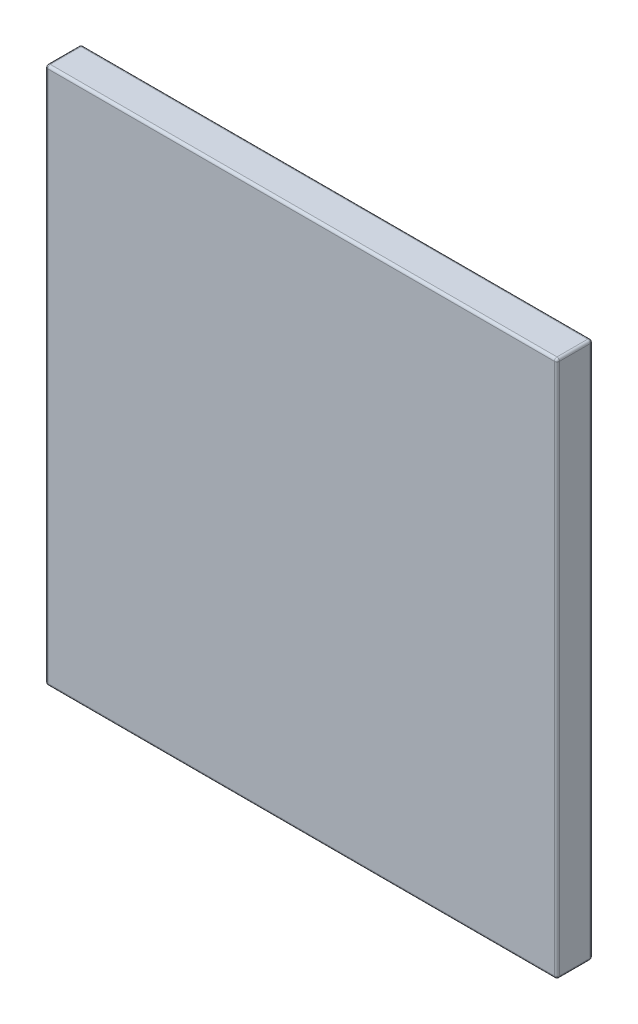
ISO-10303-21;
HEADER;
FILE_DESCRIPTION(('STEP AP214'),'2;1');
FILE_NAME('part.step','',(''),(''),'','','');
FILE_SCHEMA(('AUTOMOTIVE_DESIGN { 1 0 10303 214 1 1 1 1 }'));
ENDSEC;
DATA;
#1=APPLICATION_CONTEXT('core data for automotive mechanical design processes');
#2=APPLICATION_PROTOCOL_DEFINITION('international standard','automotive_design',2000,#1);
#3=PRODUCT_CONTEXT('',#1,'mechanical');
#4=PRODUCT('Part','Part','',(#3));
#5=PRODUCT_RELATED_PRODUCT_CATEGORY('part','',(#4));
#6=PRODUCT_DEFINITION_FORMATION('','',#4);
#7=PRODUCT_DEFINITION_CONTEXT('part definition',#1,'design');
#8=PRODUCT_DEFINITION('design','',#6,#7);
#9=PRODUCT_DEFINITION_SHAPE('','',#8);
#10=(LENGTH_UNIT() NAMED_UNIT(*) SI_UNIT(.MILLI.,.METRE.));
#11=(NAMED_UNIT(*) PLANE_ANGLE_UNIT() SI_UNIT($,.RADIAN.));
#12=(NAMED_UNIT(*) SI_UNIT($,.STERADIAN.) SOLID_ANGLE_UNIT());
#13=UNCERTAINTY_MEASURE_WITH_UNIT(LENGTH_MEASURE(1.E-05),#10,'distance_accuracy_value','');
#14=(GEOMETRIC_REPRESENTATION_CONTEXT(3) GLOBAL_UNCERTAINTY_ASSIGNED_CONTEXT((#13)) GLOBAL_UNIT_ASSIGNED_CONTEXT((#10,
#11,#12)) REPRESENTATION_CONTEXT('',''));
#15=CARTESIAN_POINT('',(0.,0.,0.));
#16=DIRECTION('',(0.,0.,1.));
#17=DIRECTION('',(1.,0.,0.));
#18=AXIS2_PLACEMENT_3D('',#15,#16,#17);
#19=CARTESIAN_POINT('',(-4.13449207157851,45.414636394646,7.));
#20=DIRECTION('',(-1.,0.,0.));
#21=DIRECTION('',(0.,-1.,0.));
#22=AXIS2_PLACEMENT_3D('',#19,#20,#21);
#23=PLANE('',#22);
#24=DIRECTION('',(0.,1.,0.));
#25=VECTOR('',#24,1.);
#26=CARTESIAN_POINT('',(-4.13449207157849,-59.585363605354,6.5));
#27=LINE('',#26,#25);
#28=CARTESIAN_POINT('',(-4.13449207157851,44.914636394646,6.5));
#29=VERTEX_POINT('',#28);
#30=CARTESIAN_POINT('',(-4.13449207157849,-59.085363605354,6.5));
#31=VERTEX_POINT('',#30);
#32=EDGE_CURVE('E174',#29,#31,#27,.F.);
#33=ORIENTED_EDGE('',*,*,#32,.T.);
#34=DIRECTION('',(0.,0.,-1.));
#35=VECTOR('',#34,1.);
#36=CARTESIAN_POINT('',(-4.13449207157849,-59.085363605354,7.));
#37=LINE('',#36,#35);
#38=CARTESIAN_POINT('',(-4.13449207157849,-59.085363605354,0.5));
#39=VERTEX_POINT('',#38);
#40=EDGE_CURVE('E141',#31,#39,#37,.T.);
#41=ORIENTED_EDGE('',*,*,#40,.T.);
#42=DIRECTION('',(0.,1.,0.));
#43=VECTOR('',#42,1.);
#44=CARTESIAN_POINT('',(-4.13449207157851,45.414636394646,0.5));
#45=LINE('',#44,#43);
#46=CARTESIAN_POINT('',(-4.13449207157851,44.914636394646,0.5));
#47=VERTEX_POINT('',#46);
#48=EDGE_CURVE('E178',#39,#47,#45,.T.);
#49=ORIENTED_EDGE('',*,*,#48,.T.);
#50=DIRECTION('',(0.,0.,-1.));
#51=VECTOR('',#50,1.);
#52=CARTESIAN_POINT('',(-4.13449207157851,44.914636394646,7.));
#53=LINE('',#52,#51);
#54=EDGE_CURVE('E176',#47,#29,#53,.F.);
#55=ORIENTED_EDGE('',*,*,#54,.T.);
#56=EDGE_LOOP('',(#33,#41,#49,#55));
#57=FACE_BOUND('',#56,.T.);
#58=ADVANCED_FACE('F34',(#57),#23,.F.);
#59=CARTESIAN_POINT('',(-104.134492071579,45.414636394646,7.));
#60=DIRECTION('',(0.,-1.,0.));
#61=DIRECTION('',(0.,0.,-1.));
#62=AXIS2_PLACEMENT_3D('',#59,#60,#61);
#63=PLANE('',#62);
#64=DIRECTION('',(-1.,0.,0.));
#65=VECTOR('',#64,1.);
#66=CARTESIAN_POINT('',(-4.13449207157851,45.414636394646,6.5));
#67=LINE('',#66,#65);
#68=CARTESIAN_POINT('',(-103.634492071579,45.414636394646,6.5));
#69=VERTEX_POINT('',#68);
#70=CARTESIAN_POINT('',(-4.63449207157851,45.414636394646,6.5));
#71=VERTEX_POINT('',#70);
#72=EDGE_CURVE('E190',#69,#71,#67,.F.);
#73=ORIENTED_EDGE('',*,*,#72,.T.);
#74=DIRECTION('',(0.,0.,-1.));
#75=VECTOR('',#74,1.);
#76=CARTESIAN_POINT('',(-4.63449207157851,45.414636394646,7.));
#77=LINE('',#76,#75);
#78=CARTESIAN_POINT('',(-4.63449207157851,45.414636394646,0.5));
#79=VERTEX_POINT('',#78);
#80=EDGE_CURVE('E196',#71,#79,#77,.T.);
#81=ORIENTED_EDGE('',*,*,#80,.T.);
#82=DIRECTION('',(-1.,0.,0.));
#83=VECTOR('',#82,1.);
#84=CARTESIAN_POINT('',(-104.134492071579,45.414636394646,0.5));
#85=LINE('',#84,#83);
#86=CARTESIAN_POINT('',(-103.634492071579,45.414636394646,0.5));
#87=VERTEX_POINT('',#86);
#88=EDGE_CURVE('E194',#79,#87,#85,.T.);
#89=ORIENTED_EDGE('',*,*,#88,.T.);
#90=DIRECTION('',(0.,0.,-1.));
#91=VECTOR('',#90,1.);
#92=CARTESIAN_POINT('',(-103.634492071579,45.414636394646,7.));
#93=LINE('',#92,#91);
#94=EDGE_CURVE('E192',#87,#69,#93,.F.);
#95=ORIENTED_EDGE('',*,*,#94,.T.);
#96=EDGE_LOOP('',(#73,#81,#89,#95));
#97=FACE_BOUND('',#96,.T.);
#98=ADVANCED_FACE('F274',(#97),#63,.F.);
#99=CARTESIAN_POINT('',(-104.134492071579,45.414636394646,7.));
#100=DIRECTION('',(1.,0.,0.));
#101=DIRECTION('',(0.,1.,0.));
#102=AXIS2_PLACEMENT_3D('',#99,#100,#101);
#103=PLANE('',#102);
#104=DIRECTION('',(0.,-1.,0.));
#105=VECTOR('',#104,1.);
#106=CARTESIAN_POINT('',(-104.134492071579,45.414636394646,0.5));
#107=LINE('',#106,#105);
#108=CARTESIAN_POINT('',(-104.134492071579,44.914636394646,0.5));
#109=VERTEX_POINT('',#108);
#110=CARTESIAN_POINT('',(-104.134492071579,-59.085363605354,0.5));
#111=VERTEX_POINT('',#110);
#112=EDGE_CURVE('E169',#109,#111,#107,.T.);
#113=ORIENTED_EDGE('',*,*,#112,.T.);
#114=DIRECTION('',(0.,0.,-1.));
#115=VECTOR('',#114,1.);
#116=CARTESIAN_POINT('',(-104.134492071579,-59.085363605354,7.));
#117=LINE('',#116,#115);
#118=CARTESIAN_POINT('',(-104.134492071579,-59.085363605354,6.5));
#119=VERTEX_POINT('',#118);
#120=EDGE_CURVE('E171',#111,#119,#117,.F.);
#121=ORIENTED_EDGE('',*,*,#120,.T.);
#122=DIRECTION('',(0.,-1.,0.));
#123=VECTOR('',#122,1.);
#124=CARTESIAN_POINT('',(-104.134492071579,45.414636394646,6.5));
#125=LINE('',#124,#123);
#126=CARTESIAN_POINT('',(-104.134492071579,44.914636394646,6.5));
#127=VERTEX_POINT('',#126);
#128=EDGE_CURVE('E165',#119,#127,#125,.F.);
#129=ORIENTED_EDGE('',*,*,#128,.T.);
#130=DIRECTION('',(0.,0.,-1.));
#131=VECTOR('',#130,1.);
#132=CARTESIAN_POINT('',(-104.134492071579,44.914636394646,7.));
#133=LINE('',#132,#131);
#134=EDGE_CURVE('E167',#127,#109,#133,.T.);
#135=ORIENTED_EDGE('',*,*,#134,.T.);
#136=EDGE_LOOP('',(#113,#121,#129,#135));
#137=FACE_BOUND('',#136,.T.);
#138=ADVANCED_FACE('F325',(#137),#103,.F.);
#139=CARTESIAN_POINT('',(-104.134492071579,-59.585363605354,7.));
#140=DIRECTION('',(0.,1.,0.));
#141=DIRECTION('',(0.,0.,1.));
#142=AXIS2_PLACEMENT_3D('',#139,#140,#141);
#143=PLANE('',#142);
#144=DIRECTION('',(0.,0.,-1.));
#145=VECTOR('',#144,1.);
#146=CARTESIAN_POINT('',(-103.634492071579,-59.585363605354,7.));
#147=LINE('',#146,#145);
#148=CARTESIAN_POINT('',(-103.634492071579,-59.585363605354,6.5));
#149=VERTEX_POINT('',#148);
#150=CARTESIAN_POINT('',(-103.634492071579,-59.585363605354,0.5));
#151=VERTEX_POINT('',#150);
#152=EDGE_CURVE('E133',#149,#151,#147,.T.);
#153=ORIENTED_EDGE('',*,*,#152,.T.);
#154=DIRECTION('',(1.,0.,0.));
#155=VECTOR('',#154,1.);
#156=CARTESIAN_POINT('',(-104.134492071579,-59.585363605354,0.5));
#157=LINE('',#156,#155);
#158=CARTESIAN_POINT('',(-4.63449207157849,-59.585363605354,0.5));
#159=VERTEX_POINT('',#158);
#160=EDGE_CURVE('E129',#151,#159,#157,.T.);
#161=ORIENTED_EDGE('',*,*,#160,.T.);
#162=DIRECTION('',(0.,0.,-1.));
#163=VECTOR('',#162,1.);
#164=CARTESIAN_POINT('',(-4.6344920715785,-59.585363605354,7.));
#165=LINE('',#164,#163);
#166=CARTESIAN_POINT('',(-4.63449207157849,-59.585363605354,6.5));
#167=VERTEX_POINT('',#166);
#168=EDGE_CURVE('E121',#159,#167,#165,.F.);
#169=ORIENTED_EDGE('',*,*,#168,.T.);
#170=DIRECTION('',(1.,0.,0.));
#171=VECTOR('',#170,1.);
#172=CARTESIAN_POINT('',(-104.134492071579,-59.585363605354,6.5));
#173=LINE('',#172,#171);
#174=EDGE_CURVE('E126',#167,#149,#173,.F.);
#175=ORIENTED_EDGE('',*,*,#174,.T.);
#176=EDGE_LOOP('',(#153,#161,#169,#175));
#177=FACE_BOUND('',#176,.T.);
#178=ADVANCED_FACE('F124',(#177),#143,.F.);
#179=CARTESIAN_POINT('',(0.,0.,7.));
#180=DIRECTION('',(0.,0.,1.));
#181=DIRECTION('',(1.,0.,0.));
#182=AXIS2_PLACEMENT_3D('',#179,#180,#181);
#183=PLANE('',#182);
#184=DIRECTION('',(0.,1.,0.));
#185=VECTOR('',#184,1.);
#186=CARTESIAN_POINT('',(-4.63449207157851,45.414636394646,7.));
#187=LINE('',#186,#185);
#188=CARTESIAN_POINT('',(-4.63449207157849,-59.085363605354,7.));
#189=VERTEX_POINT('',#188);
#190=CARTESIAN_POINT('',(-4.63449207157851,44.914636394646,7.));
#191=VERTEX_POINT('',#190);
#192=EDGE_CURVE('E43',#189,#191,#187,.T.);
#193=ORIENTED_EDGE('',*,*,#192,.T.);
#194=DIRECTION('',(-1.,0.,0.));
#195=VECTOR('',#194,1.);
#196=CARTESIAN_POINT('',(-104.134492071579,44.914636394646,7.));
#197=LINE('',#196,#195);
#198=CARTESIAN_POINT('',(-103.634492071579,44.914636394646,7.));
#199=VERTEX_POINT('',#198);
#200=EDGE_CURVE('E11',#191,#199,#197,.T.);
#201=ORIENTED_EDGE('',*,*,#200,.T.);
#202=DIRECTION('',(0.,-1.,0.));
#203=VECTOR('',#202,1.);
#204=CARTESIAN_POINT('',(-103.634492071579,-59.585363605354,7.));
#205=LINE('',#204,#203);
#206=CARTESIAN_POINT('',(-103.634492071579,-59.085363605354,7.));
#207=VERTEX_POINT('',#206);
#208=EDGE_CURVE('E199',#199,#207,#205,.T.);
#209=ORIENTED_EDGE('',*,*,#208,.T.);
#210=DIRECTION('',(1.,0.,0.));
#211=VECTOR('',#210,1.);
#212=CARTESIAN_POINT('',(-4.13449207157849,-59.085363605354,7.));
#213=LINE('',#212,#211);
#214=EDGE_CURVE('E54',#207,#189,#213,.T.);
#215=ORIENTED_EDGE('',*,*,#214,.T.);
#216=EDGE_LOOP('',(#193,#201,#209,#215));
#217=FACE_BOUND('',#216,.T.);
#218=ADVANCED_FACE('F289',(#217),#183,.T.);
#219=CARTESIAN_POINT('',(0.,0.,0.));
#220=DIRECTION('',(0.,0.,1.));
#221=DIRECTION('',(1.,0.,0.));
#222=AXIS2_PLACEMENT_3D('',#219,#220,#221);
#223=PLANE('',#222);
#224=DIRECTION('',(0.,1.,0.));
#225=VECTOR('',#224,1.);
#226=CARTESIAN_POINT('',(-4.6344920715785,0.,0.));
#227=LINE('',#226,#225);
#228=CARTESIAN_POINT('',(-4.63449207157851,44.914636394646,0.));
#229=VERTEX_POINT('',#228);
#230=CARTESIAN_POINT('',(-4.63449207157849,-59.085363605354,0.));
#231=VERTEX_POINT('',#230);
#232=EDGE_CURVE('E185',#229,#231,#227,.F.);
#233=ORIENTED_EDGE('',*,*,#232,.T.);
#234=DIRECTION('',(1.,0.,0.));
#235=VECTOR('',#234,1.);
#236=CARTESIAN_POINT('',(0.,-59.085363605354,0.));
#237=LINE('',#236,#235);
#238=CARTESIAN_POINT('',(-103.634492071579,-59.085363605354,0.));
#239=VERTEX_POINT('',#238);
#240=EDGE_CURVE('E187',#231,#239,#237,.F.);
#241=ORIENTED_EDGE('',*,*,#240,.T.);
#242=DIRECTION('',(0.,-1.,0.));
#243=VECTOR('',#242,1.);
#244=CARTESIAN_POINT('',(-103.634492071579,0.,0.));
#245=LINE('',#244,#243);
#246=CARTESIAN_POINT('',(-103.634492071579,44.914636394646,0.));
#247=VERTEX_POINT('',#246);
#248=EDGE_CURVE('E181',#239,#247,#245,.F.);
#249=ORIENTED_EDGE('',*,*,#248,.T.);
#250=DIRECTION('',(-1.,0.,0.));
#251=VECTOR('',#250,1.);
#252=CARTESIAN_POINT('',(0.,44.914636394646,0.));
#253=LINE('',#252,#251);
#254=EDGE_CURVE('E183',#247,#229,#253,.F.);
#255=ORIENTED_EDGE('',*,*,#254,.T.);
#256=EDGE_LOOP('',(#233,#241,#249,#255));
#257=FACE_BOUND('',#256,.T.);
#258=ADVANCED_FACE('F265',(#257),#223,.F.);
#259=CARTESIAN_POINT('',(-4.63449207157851,44.914636394646,7.));
#260=DIRECTION('',(0.,0.,-1.));
#261=DIRECTION('',(-1.,0.,0.));
#262=AXIS2_PLACEMENT_3D('',#259,#260,#261);
#263=CYLINDRICAL_SURFACE('',#262,0.5);
#264=CARTESIAN_POINT('',(-4.63449207157851,44.914636394646,6.5));
#265=DIRECTION('',(0.,0.,1.));
#266=DIRECTION('',(1.,0.,0.));
#267=AXIS2_PLACEMENT_3D('',#264,#265,#266);
#268=CIRCLE('',#267,0.5);
#269=EDGE_CURVE('E38',#29,#71,#268,.T.);
#270=ORIENTED_EDGE('',*,*,#269,.F.);
#271=ORIENTED_EDGE('',*,*,#54,.F.);
#272=CARTESIAN_POINT('',(-4.63449207157851,44.914636394646,0.5));
#273=DIRECTION('',(0.,0.,-1.));
#274=DIRECTION('',(-1.,0.,0.));
#275=AXIS2_PLACEMENT_3D('',#272,#273,#274);
#276=CIRCLE('',#275,0.5);
#277=EDGE_CURVE('E161',#79,#47,#276,.T.);
#278=ORIENTED_EDGE('',*,*,#277,.F.);
#279=ORIENTED_EDGE('',*,*,#80,.F.);
#280=EDGE_LOOP('',(#270,#271,#278,#279));
#281=FACE_BOUND('',#280,.T.);
#282=ADVANCED_FACE('F36',(#281),#263,.T.);
#283=CARTESIAN_POINT('',(-4.63449207157851,44.914636394646,6.5));
#284=DIRECTION('',(0.,0.,1.));
#285=DIRECTION('',(1.,0.,0.));
#286=AXIS2_PLACEMENT_3D('',#283,#284,#285);
#287=SPHERICAL_SURFACE('',#286,0.5);
#288=CARTESIAN_POINT('',(-4.63449207157851,44.914636394646,6.5));
#289=DIRECTION('',(0.,1.,0.));
#290=DIRECTION('',(0.,0.,1.));
#291=AXIS2_PLACEMENT_3D('',#288,#289,#290);
#292=CIRCLE('',#291,0.5);
#293=EDGE_CURVE('E245',#29,#191,#292,.F.);
#294=ORIENTED_EDGE('',*,*,#293,.F.);
#295=ORIENTED_EDGE('',*,*,#269,.T.);
#296=CARTESIAN_POINT('',(-4.63449207157851,44.914636394646,6.5));
#297=DIRECTION('',(1.,0.,0.));
#298=DIRECTION('',(0.,0.,-1.));
#299=AXIS2_PLACEMENT_3D('',#296,#297,#298);
#300=CIRCLE('',#299,0.5);
#301=EDGE_CURVE('E247',#191,#71,#300,.F.);
#302=ORIENTED_EDGE('',*,*,#301,.F.);
#303=EDGE_LOOP('',(#294,#295,#302));
#304=FACE_BOUND('',#303,.T.);
#305=ADVANCED_FACE('F458',(#304),#287,.T.);
#306=CARTESIAN_POINT('',(-4.63449207157851,44.914636394646,0.5));
#307=DIRECTION('',(0.,0.,1.));
#308=DIRECTION('',(1.,0.,0.));
#309=AXIS2_PLACEMENT_3D('',#306,#307,#308);
#310=SPHERICAL_SURFACE('',#309,0.5);
#311=CARTESIAN_POINT('',(-4.63449207157851,44.914636394646,0.5));
#312=DIRECTION('',(1.,0.,0.));
#313=DIRECTION('',(0.,1.,0.));
#314=AXIS2_PLACEMENT_3D('',#311,#312,#313);
#315=CIRCLE('',#314,0.5);
#316=EDGE_CURVE('E239',#79,#229,#315,.F.);
#317=ORIENTED_EDGE('',*,*,#316,.F.);
#318=ORIENTED_EDGE('',*,*,#277,.T.);
#319=CARTESIAN_POINT('',(-4.63449207157851,44.914636394646,0.5));
#320=DIRECTION('',(0.,1.,0.));
#321=DIRECTION('',(0.,0.,1.));
#322=AXIS2_PLACEMENT_3D('',#319,#320,#321);
#323=CIRCLE('',#322,0.5);
#324=EDGE_CURVE('E242',#229,#47,#323,.F.);
#325=ORIENTED_EDGE('',*,*,#324,.F.);
#326=EDGE_LOOP('',(#317,#318,#325));
#327=FACE_BOUND('',#326,.T.);
#328=ADVANCED_FACE('F254',(#327),#310,.T.);
#329=CARTESIAN_POINT('',(0.,44.914636394646,6.5));
#330=DIRECTION('',(1.,0.,0.));
#331=DIRECTION('',(0.,0.,-1.));
#332=AXIS2_PLACEMENT_3D('',#329,#330,#331);
#333=CYLINDRICAL_SURFACE('',#332,0.5);
#334=ORIENTED_EDGE('',*,*,#301,.T.);
#335=ORIENTED_EDGE('',*,*,#72,.F.);
#336=CARTESIAN_POINT('',(-103.634492071579,44.914636394646,6.5));
#337=DIRECTION('',(-1.,0.,0.));
#338=DIRECTION('',(0.,0.,1.));
#339=AXIS2_PLACEMENT_3D('',#336,#337,#338);
#340=CIRCLE('',#339,0.5);
#341=EDGE_CURVE('E233',#199,#69,#340,.T.);
#342=ORIENTED_EDGE('',*,*,#341,.F.);
#343=ORIENTED_EDGE('',*,*,#200,.F.);
#344=EDGE_LOOP('',(#334,#335,#342,#343));
#345=FACE_BOUND('',#344,.T.);
#346=ADVANCED_FACE('F288',(#345),#333,.T.);
#347=CARTESIAN_POINT('',(-4.6344920715785,0.,6.5));
#348=DIRECTION('',(0.,-1.,0.));
#349=DIRECTION('',(1.,0.,0.));
#350=AXIS2_PLACEMENT_3D('',#347,#348,#349);
#351=CYLINDRICAL_SURFACE('',#350,0.5);
#352=ORIENTED_EDGE('',*,*,#293,.T.);
#353=ORIENTED_EDGE('',*,*,#192,.F.);
#354=CARTESIAN_POINT('',(-4.63449207157849,-59.085363605354,6.5));
#355=DIRECTION('',(0.,-1.,0.));
#356=DIRECTION('',(0.,0.,-1.));
#357=AXIS2_PLACEMENT_3D('',#354,#355,#356);
#358=CIRCLE('',#357,0.5);
#359=EDGE_CURVE('E145',#31,#189,#358,.T.);
#360=ORIENTED_EDGE('',*,*,#359,.F.);
#361=ORIENTED_EDGE('',*,*,#32,.F.);
#362=EDGE_LOOP('',(#352,#353,#360,#361));
#363=FACE_BOUND('',#362,.T.);
#364=ADVANCED_FACE('F435',(#363),#351,.T.);
#365=CARTESIAN_POINT('',(-4.63449207157849,-59.085363605354,7.));
#366=DIRECTION('',(0.,0.,-1.));
#367=DIRECTION('',(-1.,0.,0.));
#368=AXIS2_PLACEMENT_3D('',#365,#366,#367);
#369=CYLINDRICAL_SURFACE('',#368,0.5);
#370=CARTESIAN_POINT('',(-4.63449207157849,-59.085363605354,0.5));
#371=DIRECTION('',(0.,0.,-1.));
#372=DIRECTION('',(-1.,0.,0.));
#373=AXIS2_PLACEMENT_3D('',#370,#371,#372);
#374=CIRCLE('',#373,0.5);
#375=EDGE_CURVE('E146',#39,#159,#374,.T.);
#376=ORIENTED_EDGE('',*,*,#375,.F.);
#377=ORIENTED_EDGE('',*,*,#40,.F.);
#378=CARTESIAN_POINT('',(-4.63449207157849,-59.085363605354,6.5));
#379=DIRECTION('',(0.,0.,1.));
#380=DIRECTION('',(1.,0.,0.));
#381=AXIS2_PLACEMENT_3D('',#378,#379,#380);
#382=CIRCLE('',#381,0.5);
#383=EDGE_CURVE('E137',#167,#31,#382,.T.);
#384=ORIENTED_EDGE('',*,*,#383,.F.);
#385=ORIENTED_EDGE('',*,*,#168,.F.);
#386=EDGE_LOOP('',(#376,#377,#384,#385));
#387=FACE_BOUND('',#386,.T.);
#388=ADVANCED_FACE('F139',(#387),#369,.T.);
#389=CARTESIAN_POINT('',(-4.63449207157851,45.414636394646,0.5));
#390=DIRECTION('',(0.,1.,0.));
#391=DIRECTION('',(-1.,0.,0.));
#392=AXIS2_PLACEMENT_3D('',#389,#390,#391);
#393=CYLINDRICAL_SURFACE('',#392,0.5);
#394=ORIENTED_EDGE('',*,*,#324,.T.);
#395=ORIENTED_EDGE('',*,*,#48,.F.);
#396=CARTESIAN_POINT('',(-4.63449207157849,-59.085363605354,0.5));
#397=DIRECTION('',(0.,-1.,0.));
#398=DIRECTION('',(0.,0.,-1.));
#399=AXIS2_PLACEMENT_3D('',#396,#397,#398);
#400=CIRCLE('',#399,0.5);
#401=EDGE_CURVE('E229',#231,#39,#400,.T.);
#402=ORIENTED_EDGE('',*,*,#401,.F.);
#403=ORIENTED_EDGE('',*,*,#232,.F.);
#404=EDGE_LOOP('',(#394,#395,#402,#403));
#405=FACE_BOUND('',#404,.T.);
#406=ADVANCED_FACE('F261',(#405),#393,.T.);
#407=CARTESIAN_POINT('',(-104.134492071579,44.914636394646,0.5));
#408=DIRECTION('',(-1.,0.,0.));
#409=DIRECTION('',(0.,0.,1.));
#410=AXIS2_PLACEMENT_3D('',#407,#408,#409);
#411=CYLINDRICAL_SURFACE('',#410,0.5);
#412=ORIENTED_EDGE('',*,*,#316,.T.);
#413=ORIENTED_EDGE('',*,*,#254,.F.);
#414=CARTESIAN_POINT('',(-103.634492071579,44.914636394646,0.5));
#415=DIRECTION('',(-1.,0.,0.));
#416=DIRECTION('',(0.,0.,1.));
#417=AXIS2_PLACEMENT_3D('',#414,#415,#416);
#418=CIRCLE('',#417,0.5);
#419=EDGE_CURVE('E226',#87,#247,#418,.T.);
#420=ORIENTED_EDGE('',*,*,#419,.F.);
#421=ORIENTED_EDGE('',*,*,#88,.F.);
#422=EDGE_LOOP('',(#412,#413,#420,#421));
#423=FACE_BOUND('',#422,.T.);
#424=ADVANCED_FACE('F271',(#423),#411,.T.);
#425=CARTESIAN_POINT('',(-103.634492071579,44.914636394646,7.));
#426=DIRECTION('',(0.,0.,-1.));
#427=DIRECTION('',(-1.,0.,0.));
#428=AXIS2_PLACEMENT_3D('',#425,#426,#427);
#429=CYLINDRICAL_SURFACE('',#428,0.5);
#430=CARTESIAN_POINT('',(-103.634492071579,44.914636394646,6.5));
#431=DIRECTION('',(0.,0.,1.));
#432=DIRECTION('',(1.,0.,0.));
#433=AXIS2_PLACEMENT_3D('',#430,#431,#432);
#434=CIRCLE('',#433,0.5);
#435=EDGE_CURVE('E236',#69,#127,#434,.T.);
#436=ORIENTED_EDGE('',*,*,#435,.F.);
#437=ORIENTED_EDGE('',*,*,#94,.F.);
#438=CARTESIAN_POINT('',(-103.634492071579,44.914636394646,0.5));
#439=DIRECTION('',(0.,0.,-1.));
#440=DIRECTION('',(-1.,0.,0.));
#441=AXIS2_PLACEMENT_3D('',#438,#439,#440);
#442=CIRCLE('',#441,0.5);
#443=EDGE_CURVE('E223',#109,#87,#442,.T.);
#444=ORIENTED_EDGE('',*,*,#443,.F.);
#445=ORIENTED_EDGE('',*,*,#134,.F.);
#446=EDGE_LOOP('',(#436,#437,#444,#445));
#447=FACE_BOUND('',#446,.T.);
#448=ADVANCED_FACE('F279',(#447),#429,.T.);
#449=CARTESIAN_POINT('',(-103.634492071579,44.914636394646,6.5));
#450=DIRECTION('',(0.,0.,1.));
#451=DIRECTION('',(1.,0.,0.));
#452=AXIS2_PLACEMENT_3D('',#449,#450,#451);
#453=SPHERICAL_SURFACE('',#452,0.5);
#454=ORIENTED_EDGE('',*,*,#341,.T.);
#455=ORIENTED_EDGE('',*,*,#435,.T.);
#456=CARTESIAN_POINT('',(-103.634492071579,44.914636394646,6.5));
#457=DIRECTION('',(0.,1.,0.));
#458=DIRECTION('',(0.,0.,1.));
#459=AXIS2_PLACEMENT_3D('',#456,#457,#458);
#460=CIRCLE('',#459,0.5);
#461=EDGE_CURVE('E152',#199,#127,#460,.F.);
#462=ORIENTED_EDGE('',*,*,#461,.F.);
#463=EDGE_LOOP('',(#454,#455,#462));
#464=FACE_BOUND('',#463,.T.);
#465=ADVANCED_FACE('F285',(#464),#453,.T.);
#466=CARTESIAN_POINT('',(-4.63449207157849,-59.085363605354,6.5));
#467=DIRECTION('',(0.,0.,1.));
#468=DIRECTION('',(1.,0.,0.));
#469=AXIS2_PLACEMENT_3D('',#466,#467,#468);
#470=SPHERICAL_SURFACE('',#469,0.5);
#471=ORIENTED_EDGE('',*,*,#383,.T.);
#472=ORIENTED_EDGE('',*,*,#359,.T.);
#473=CARTESIAN_POINT('',(-4.63449207157849,-59.085363605354,6.5));
#474=DIRECTION('',(1.,0.,0.));
#475=DIRECTION('',(0.,0.,-1.));
#476=AXIS2_PLACEMENT_3D('',#473,#474,#475);
#477=CIRCLE('',#476,0.5);
#478=EDGE_CURVE('E149',#167,#189,#477,.F.);
#479=ORIENTED_EDGE('',*,*,#478,.F.);
#480=EDGE_LOOP('',(#471,#472,#479));
#481=FACE_BOUND('',#480,.T.);
#482=ADVANCED_FACE('F150',(#481),#470,.T.);
#483=CARTESIAN_POINT('',(-4.63449207157849,-59.085363605354,0.5));
#484=DIRECTION('',(0.,0.,1.));
#485=DIRECTION('',(1.,0.,0.));
#486=AXIS2_PLACEMENT_3D('',#483,#484,#485);
#487=SPHERICAL_SURFACE('',#486,0.5);
#488=ORIENTED_EDGE('',*,*,#401,.T.);
#489=ORIENTED_EDGE('',*,*,#375,.T.);
#490=CARTESIAN_POINT('',(-4.63449207157849,-59.085363605354,0.5));
#491=DIRECTION('',(1.,0.,0.));
#492=DIRECTION('',(0.,0.,-1.));
#493=AXIS2_PLACEMENT_3D('',#490,#491,#492);
#494=CIRCLE('',#493,0.5);
#495=EDGE_CURVE('E153',#231,#159,#494,.F.);
#496=ORIENTED_EDGE('',*,*,#495,.F.);
#497=EDGE_LOOP('',(#488,#489,#496));
#498=FACE_BOUND('',#497,.T.);
#499=ADVANCED_FACE('F308',(#498),#487,.T.);
#500=CARTESIAN_POINT('',(-103.634492071579,44.914636394646,0.5));
#501=DIRECTION('',(0.,0.,1.));
#502=DIRECTION('',(1.,0.,0.));
#503=AXIS2_PLACEMENT_3D('',#500,#501,#502);
#504=SPHERICAL_SURFACE('',#503,0.5);
#505=ORIENTED_EDGE('',*,*,#443,.T.);
#506=ORIENTED_EDGE('',*,*,#419,.T.);
#507=CARTESIAN_POINT('',(-103.634492071579,44.914636394646,0.5));
#508=DIRECTION('',(0.,1.,0.));
#509=DIRECTION('',(0.,0.,1.));
#510=AXIS2_PLACEMENT_3D('',#507,#508,#509);
#511=CIRCLE('',#510,0.5);
#512=EDGE_CURVE('E216',#109,#247,#511,.F.);
#513=ORIENTED_EDGE('',*,*,#512,.F.);
#514=EDGE_LOOP('',(#505,#506,#513));
#515=FACE_BOUND('',#514,.T.);
#516=ADVANCED_FACE('F310',(#515),#504,.T.);
#517=CARTESIAN_POINT('',(-103.634492071579,0.,6.5));
#518=DIRECTION('',(0.,1.,0.));
#519=DIRECTION('',(-1.,0.,0.));
#520=AXIS2_PLACEMENT_3D('',#517,#518,#519);
#521=CYLINDRICAL_SURFACE('',#520,0.5);
#522=ORIENTED_EDGE('',*,*,#461,.T.);
#523=ORIENTED_EDGE('',*,*,#128,.F.);
#524=CARTESIAN_POINT('',(-103.634492071579,-59.085363605354,6.5));
#525=DIRECTION('',(0.,-1.,0.));
#526=DIRECTION('',(0.,0.,-1.));
#527=AXIS2_PLACEMENT_3D('',#524,#525,#526);
#528=CIRCLE('',#527,0.5);
#529=EDGE_CURVE('E213',#207,#119,#528,.T.);
#530=ORIENTED_EDGE('',*,*,#529,.F.);
#531=ORIENTED_EDGE('',*,*,#208,.F.);
#532=EDGE_LOOP('',(#522,#523,#530,#531));
#533=FACE_BOUND('',#532,.T.);
#534=ADVANCED_FACE('F293',(#533),#521,.T.);
#535=CARTESIAN_POINT('',(0.,-59.085363605354,6.5));
#536=DIRECTION('',(-1.,0.,0.));
#537=DIRECTION('',(0.,0.,1.));
#538=AXIS2_PLACEMENT_3D('',#535,#536,#537);
#539=CYLINDRICAL_SURFACE('',#538,0.5);
#540=ORIENTED_EDGE('',*,*,#478,.T.);
#541=ORIENTED_EDGE('',*,*,#214,.F.);
#542=CARTESIAN_POINT('',(-103.634492071579,-59.085363605354,6.5));
#543=DIRECTION('',(-1.,0.,0.));
#544=DIRECTION('',(0.,0.,1.));
#545=AXIS2_PLACEMENT_3D('',#542,#543,#544);
#546=CIRCLE('',#545,0.5);
#547=EDGE_CURVE('E157',#149,#207,#546,.T.);
#548=ORIENTED_EDGE('',*,*,#547,.F.);
#549=ORIENTED_EDGE('',*,*,#174,.F.);
#550=EDGE_LOOP('',(#540,#541,#548,#549));
#551=FACE_BOUND('',#550,.T.);
#552=ADVANCED_FACE('F155',(#551),#539,.T.);
#553=CARTESIAN_POINT('',(-104.134492071579,-59.085363605354,0.5));
#554=DIRECTION('',(1.,0.,0.));
#555=DIRECTION('',(0.,0.,-1.));
#556=AXIS2_PLACEMENT_3D('',#553,#554,#555);
#557=CYLINDRICAL_SURFACE('',#556,0.5);
#558=ORIENTED_EDGE('',*,*,#495,.T.);
#559=ORIENTED_EDGE('',*,*,#160,.F.);
#560=CARTESIAN_POINT('',(-103.634492071579,-59.085363605354,0.5));
#561=DIRECTION('',(-1.,0.,0.));
#562=DIRECTION('',(0.,0.,1.));
#563=AXIS2_PLACEMENT_3D('',#560,#561,#562);
#564=CIRCLE('',#563,0.5);
#565=EDGE_CURVE('E209',#239,#151,#564,.T.);
#566=ORIENTED_EDGE('',*,*,#565,.F.);
#567=ORIENTED_EDGE('',*,*,#240,.F.);
#568=EDGE_LOOP('',(#558,#559,#566,#567));
#569=FACE_BOUND('',#568,.T.);
#570=ADVANCED_FACE('F306',(#569),#557,.T.);
#571=CARTESIAN_POINT('',(-103.634492071579,45.414636394646,0.5));
#572=DIRECTION('',(0.,-1.,0.));
#573=DIRECTION('',(1.,0.,0.));
#574=AXIS2_PLACEMENT_3D('',#571,#572,#573);
#575=CYLINDRICAL_SURFACE('',#574,0.5);
#576=ORIENTED_EDGE('',*,*,#512,.T.);
#577=ORIENTED_EDGE('',*,*,#248,.F.);
#578=CARTESIAN_POINT('',(-103.634492071579,-59.085363605354,0.5));
#579=DIRECTION('',(0.,-1.,0.));
#580=DIRECTION('',(0.,0.,-1.));
#581=AXIS2_PLACEMENT_3D('',#578,#579,#580);
#582=CIRCLE('',#581,0.5);
#583=EDGE_CURVE('E207',#111,#239,#582,.T.);
#584=ORIENTED_EDGE('',*,*,#583,.F.);
#585=ORIENTED_EDGE('',*,*,#112,.F.);
#586=EDGE_LOOP('',(#576,#577,#584,#585));
#587=FACE_BOUND('',#586,.T.);
#588=ADVANCED_FACE('F335',(#587),#575,.T.);
#589=CARTESIAN_POINT('',(-103.634492071579,-59.085363605354,6.5));
#590=DIRECTION('',(0.,0.,1.));
#591=DIRECTION('',(1.,0.,0.));
#592=AXIS2_PLACEMENT_3D('',#589,#590,#591);
#593=SPHERICAL_SURFACE('',#592,0.5);
#594=ORIENTED_EDGE('',*,*,#547,.T.);
#595=ORIENTED_EDGE('',*,*,#529,.T.);
#596=CARTESIAN_POINT('',(-103.634492071579,-59.085363605354,6.5));
#597=DIRECTION('',(0.,0.,1.));
#598=DIRECTION('',(1.,0.,0.));
#599=AXIS2_PLACEMENT_3D('',#596,#597,#598);
#600=CIRCLE('',#599,0.5);
#601=EDGE_CURVE('E205',#149,#119,#600,.F.);
#602=ORIENTED_EDGE('',*,*,#601,.F.);
#603=EDGE_LOOP('',(#594,#595,#602));
#604=FACE_BOUND('',#603,.T.);
#605=ADVANCED_FACE('F295',(#604),#593,.T.);
#606=CARTESIAN_POINT('',(-103.634492071579,-59.085363605354,0.5));
#607=DIRECTION('',(0.,0.,1.));
#608=DIRECTION('',(1.,0.,0.));
#609=AXIS2_PLACEMENT_3D('',#606,#607,#608);
#610=SPHERICAL_SURFACE('',#609,0.5);
#611=ORIENTED_EDGE('',*,*,#583,.T.);
#612=ORIENTED_EDGE('',*,*,#565,.T.);
#613=CARTESIAN_POINT('',(-103.634492071579,-59.085363605354,0.5));
#614=DIRECTION('',(0.,0.,-1.));
#615=DIRECTION('',(-1.,0.,0.));
#616=AXIS2_PLACEMENT_3D('',#613,#614,#615);
#617=CIRCLE('',#616,0.5);
#618=EDGE_CURVE('E203',#111,#151,#617,.F.);
#619=ORIENTED_EDGE('',*,*,#618,.F.);
#620=EDGE_LOOP('',(#611,#612,#619));
#621=FACE_BOUND('',#620,.T.);
#622=ADVANCED_FACE('F303',(#621),#610,.T.);
#623=CARTESIAN_POINT('',(-103.634492071579,-59.085363605354,7.));
#624=DIRECTION('',(0.,0.,-1.));
#625=DIRECTION('',(-1.,0.,0.));
#626=AXIS2_PLACEMENT_3D('',#623,#624,#625);
#627=CYLINDRICAL_SURFACE('',#626,0.5);
#628=ORIENTED_EDGE('',*,*,#601,.T.);
#629=ORIENTED_EDGE('',*,*,#120,.F.);
#630=ORIENTED_EDGE('',*,*,#618,.T.);
#631=ORIENTED_EDGE('',*,*,#152,.F.);
#632=EDGE_LOOP('',(#628,#629,#630,#631));
#633=FACE_BOUND('',#632,.T.);
#634=ADVANCED_FACE('F299',(#633),#627,.T.);
#635=CLOSED_SHELL('',(#58,#98,#138,#178,#218,#258,#282,#305,#328,#346,#364,#388,#406,#424,#448,
#465,#482,#499,#516,#534,#552,#570,#588,#605,#622,#634));
#636=MANIFOLD_SOLID_BREP('B2',#635);
#637=ADVANCED_BREP_SHAPE_REPRESENTATION('',(#18,#636),#14);
#638=SHAPE_DEFINITION_REPRESENTATION(#9,#637);
ENDSEC;
END-ISO-10303-21;
